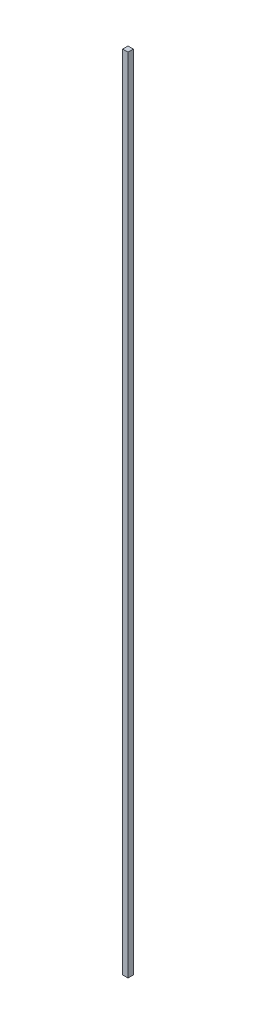
ISO-10303-21;
HEADER;
FILE_DESCRIPTION(('STEP AP214'),'2;1');
FILE_NAME('part.step','',(''),(''),'','','');
FILE_SCHEMA(('AUTOMOTIVE_DESIGN { 1 0 10303 214 1 1 1 1 }'));
ENDSEC;
DATA;
#1=APPLICATION_CONTEXT('core data for automotive mechanical design processes');
#2=APPLICATION_PROTOCOL_DEFINITION('international standard','automotive_design',2000,#1);
#3=PRODUCT_CONTEXT('',#1,'mechanical');
#4=PRODUCT('Part','Part','',(#3));
#5=PRODUCT_RELATED_PRODUCT_CATEGORY('part','',(#4));
#6=PRODUCT_DEFINITION_FORMATION('','',#4);
#7=PRODUCT_DEFINITION_CONTEXT('part definition',#1,'design');
#8=PRODUCT_DEFINITION('design','',#6,#7);
#9=PRODUCT_DEFINITION_SHAPE('','',#8);
#10=(LENGTH_UNIT() NAMED_UNIT(*) SI_UNIT(.MILLI.,.METRE.));
#11=(NAMED_UNIT(*) PLANE_ANGLE_UNIT() SI_UNIT($,.RADIAN.));
#12=(NAMED_UNIT(*) SI_UNIT($,.STERADIAN.) SOLID_ANGLE_UNIT());
#13=UNCERTAINTY_MEASURE_WITH_UNIT(LENGTH_MEASURE(1.E-05),#10,'distance_accuracy_value','');
#14=(GEOMETRIC_REPRESENTATION_CONTEXT(3) GLOBAL_UNCERTAINTY_ASSIGNED_CONTEXT((#13)) GLOBAL_UNIT_ASSIGNED_CONTEXT((#10,
#11,#12)) REPRESENTATION_CONTEXT('',''));
#15=CARTESIAN_POINT('',(0.,0.,0.));
#16=DIRECTION('',(0.,0.,1.));
#17=DIRECTION('',(1.,0.,0.));
#18=AXIS2_PLACEMENT_3D('',#15,#16,#17);
#19=CARTESIAN_POINT('',(5.,1500.,5.));
#20=DIRECTION('',(-1.,0.,0.));
#21=DIRECTION('',(0.,0.,1.));
#22=AXIS2_PLACEMENT_3D('',#19,#20,#21);
#23=PLANE('',#22);
#24=DIRECTION('',(0.,0.,-1.));
#25=VECTOR('',#24,1.);
#26=CARTESIAN_POINT('',(5.,0.,5.));
#27=LINE('',#26,#25);
#28=CARTESIAN_POINT('',(5.,0.,5.));
#29=VERTEX_POINT('',#28);
#30=CARTESIAN_POINT('',(5.,0.,-5.));
#31=VERTEX_POINT('',#30);
#32=EDGE_CURVE('E107',#29,#31,#27,.T.);
#33=ORIENTED_EDGE('',*,*,#32,.T.);
#34=DIRECTION('',(0.,-1.,0.));
#35=VECTOR('',#34,1.);
#36=CARTESIAN_POINT('',(5.,1500.,-5.));
#37=LINE('',#36,#35);
#38=CARTESIAN_POINT('',(5.,1500.,-5.));
#39=VERTEX_POINT('',#38);
#40=EDGE_CURVE('E11',#39,#31,#37,.T.);
#41=ORIENTED_EDGE('',*,*,#40,.F.);
#42=DIRECTION('',(0.,0.,-1.));
#43=VECTOR('',#42,1.);
#44=CARTESIAN_POINT('',(5.,1500.,5.));
#45=LINE('',#44,#43);
#46=CARTESIAN_POINT('',(5.,1500.,5.));
#47=VERTEX_POINT('',#46);
#48=EDGE_CURVE('E91',#47,#39,#45,.T.);
#49=ORIENTED_EDGE('',*,*,#48,.F.);
#50=DIRECTION('',(0.,-1.,0.));
#51=VECTOR('',#50,1.);
#52=CARTESIAN_POINT('',(5.,1500.,5.));
#53=LINE('',#52,#51);
#54=EDGE_CURVE('E103',#47,#29,#53,.T.);
#55=ORIENTED_EDGE('',*,*,#54,.T.);
#56=EDGE_LOOP('',(#33,#41,#49,#55));
#57=FACE_BOUND('',#56,.T.);
#58=ADVANCED_FACE('F39',(#57),#23,.F.);
#59=CARTESIAN_POINT('',(-5.,1500.,-5.));
#60=DIRECTION('',(0.,0.,1.));
#61=DIRECTION('',(1.,0.,0.));
#62=AXIS2_PLACEMENT_3D('',#59,#60,#61);
#63=PLANE('',#62);
#64=DIRECTION('',(-1.,0.,0.));
#65=VECTOR('',#64,1.);
#66=CARTESIAN_POINT('',(-5.,0.,-5.));
#67=LINE('',#66,#65);
#68=CARTESIAN_POINT('',(-5.,0.,-5.));
#69=VERTEX_POINT('',#68);
#70=EDGE_CURVE('E96',#31,#69,#67,.T.);
#71=ORIENTED_EDGE('',*,*,#70,.T.);
#72=DIRECTION('',(0.,-1.,0.));
#73=VECTOR('',#72,1.);
#74=CARTESIAN_POINT('',(-5.,1500.,-5.));
#75=LINE('',#74,#73);
#76=CARTESIAN_POINT('',(-5.,1500.,-5.));
#77=VERTEX_POINT('',#76);
#78=EDGE_CURVE('E48',#77,#69,#75,.T.);
#79=ORIENTED_EDGE('',*,*,#78,.F.);
#80=DIRECTION('',(-1.,0.,0.));
#81=VECTOR('',#80,1.);
#82=CARTESIAN_POINT('',(-5.,1500.,-5.));
#83=LINE('',#82,#81);
#84=EDGE_CURVE('E86',#39,#77,#83,.T.);
#85=ORIENTED_EDGE('',*,*,#84,.F.);
#86=ORIENTED_EDGE('',*,*,#40,.T.);
#87=EDGE_LOOP('',(#71,#79,#85,#86));
#88=FACE_BOUND('',#87,.T.);
#89=ADVANCED_FACE('F95',(#88),#63,.F.);
#90=CARTESIAN_POINT('',(-5.,1500.,5.));
#91=DIRECTION('',(1.,0.,0.));
#92=DIRECTION('',(0.,0.,-1.));
#93=AXIS2_PLACEMENT_3D('',#90,#91,#92);
#94=PLANE('',#93);
#95=DIRECTION('',(0.,0.,1.));
#96=VECTOR('',#95,1.);
#97=CARTESIAN_POINT('',(-5.,0.,5.));
#98=LINE('',#97,#96);
#99=CARTESIAN_POINT('',(-5.,0.,5.));
#100=VERTEX_POINT('',#99);
#101=EDGE_CURVE('E73',#69,#100,#98,.T.);
#102=ORIENTED_EDGE('',*,*,#101,.T.);
#103=DIRECTION('',(0.,-1.,0.));
#104=VECTOR('',#103,1.);
#105=CARTESIAN_POINT('',(-5.,1500.,5.));
#106=LINE('',#105,#104);
#107=CARTESIAN_POINT('',(-5.,1500.,5.));
#108=VERTEX_POINT('',#107);
#109=EDGE_CURVE('E98',#108,#100,#106,.T.);
#110=ORIENTED_EDGE('',*,*,#109,.F.);
#111=DIRECTION('',(0.,0.,1.));
#112=VECTOR('',#111,1.);
#113=CARTESIAN_POINT('',(-5.,1500.,5.));
#114=LINE('',#113,#112);
#115=EDGE_CURVE('E89',#77,#108,#114,.T.);
#116=ORIENTED_EDGE('',*,*,#115,.F.);
#117=ORIENTED_EDGE('',*,*,#78,.T.);
#118=EDGE_LOOP('',(#102,#110,#116,#117));
#119=FACE_BOUND('',#118,.T.);
#120=ADVANCED_FACE('F99',(#119),#94,.F.);
#121=CARTESIAN_POINT('',(-5.,1500.,5.));
#122=DIRECTION('',(0.,0.,-1.));
#123=DIRECTION('',(-1.,0.,0.));
#124=AXIS2_PLACEMENT_3D('',#121,#122,#123);
#125=PLANE('',#124);
#126=DIRECTION('',(1.,0.,0.));
#127=VECTOR('',#126,1.);
#128=CARTESIAN_POINT('',(-5.,0.,5.));
#129=LINE('',#128,#127);
#130=EDGE_CURVE('E79',#100,#29,#129,.T.);
#131=ORIENTED_EDGE('',*,*,#130,.T.);
#132=ORIENTED_EDGE('',*,*,#54,.F.);
#133=DIRECTION('',(1.,0.,0.));
#134=VECTOR('',#133,1.);
#135=CARTESIAN_POINT('',(-5.,1500.,5.));
#136=LINE('',#135,#134);
#137=EDGE_CURVE('E56',#108,#47,#136,.T.);
#138=ORIENTED_EDGE('',*,*,#137,.F.);
#139=ORIENTED_EDGE('',*,*,#109,.T.);
#140=EDGE_LOOP('',(#131,#132,#138,#139));
#141=FACE_BOUND('',#140,.T.);
#142=ADVANCED_FACE('F120',(#141),#125,.F.);
#143=CARTESIAN_POINT('',(0.,1500.,0.));
#144=DIRECTION('',(0.,-1.,0.));
#145=DIRECTION('',(0.,0.,-1.));
#146=AXIS2_PLACEMENT_3D('',#143,#144,#145);
#147=PLANE('',#146);
#148=ORIENTED_EDGE('',*,*,#48,.T.);
#149=ORIENTED_EDGE('',*,*,#84,.T.);
#150=ORIENTED_EDGE('',*,*,#115,.T.);
#151=ORIENTED_EDGE('',*,*,#137,.T.);
#152=EDGE_LOOP('',(#148,#149,#150,#151));
#153=FACE_BOUND('',#152,.T.);
#154=ADVANCED_FACE('F87',(#153),#147,.F.);
#155=CARTESIAN_POINT('',(0.,0.,0.));
#156=DIRECTION('',(0.,-1.,0.));
#157=DIRECTION('',(0.,0.,-1.));
#158=AXIS2_PLACEMENT_3D('',#155,#156,#157);
#159=PLANE('',#158);
#160=ORIENTED_EDGE('',*,*,#32,.F.);
#161=ORIENTED_EDGE('',*,*,#130,.F.);
#162=ORIENTED_EDGE('',*,*,#101,.F.);
#163=ORIENTED_EDGE('',*,*,#70,.F.);
#164=EDGE_LOOP('',(#160,#161,#162,#163));
#165=FACE_BOUND('',#164,.T.);
#166=ADVANCED_FACE('F123',(#165),#159,.T.);
#167=CLOSED_SHELL('',(#58,#89,#120,#142,#154,#166));
#168=MANIFOLD_SOLID_BREP('B2',#167);
#169=ADVANCED_BREP_SHAPE_REPRESENTATION('',(#18,#168),#14);
#170=SHAPE_DEFINITION_REPRESENTATION(#9,#169);
ENDSEC;
END-ISO-10303-21;
